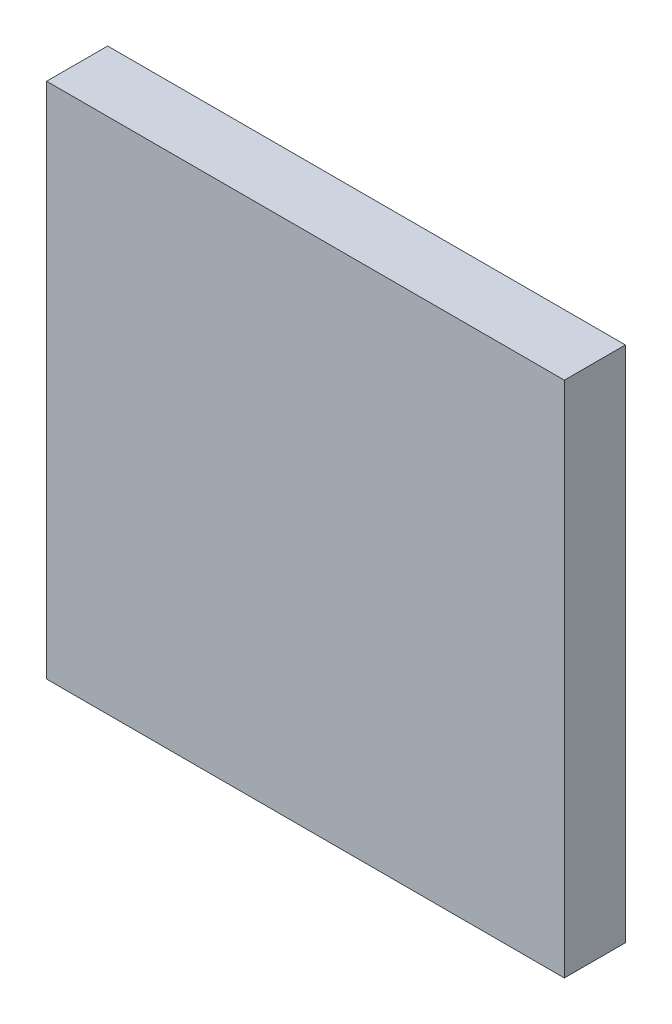
ISO-10303-21;
HEADER;
FILE_DESCRIPTION(('STEP AP214'),'2;1');
FILE_NAME('part.step','',(''),(''),'','','');
FILE_SCHEMA(('AUTOMOTIVE_DESIGN { 1 0 10303 214 1 1 1 1 }'));
ENDSEC;
DATA;
#1=APPLICATION_CONTEXT('core data for automotive mechanical design processes');
#2=APPLICATION_PROTOCOL_DEFINITION('international standard','automotive_design',2000,#1);
#3=PRODUCT_CONTEXT('',#1,'mechanical');
#4=PRODUCT('Part','Part','',(#3));
#5=PRODUCT_RELATED_PRODUCT_CATEGORY('part','',(#4));
#6=PRODUCT_DEFINITION_FORMATION('','',#4);
#7=PRODUCT_DEFINITION_CONTEXT('part definition',#1,'design');
#8=PRODUCT_DEFINITION('design','',#6,#7);
#9=PRODUCT_DEFINITION_SHAPE('','',#8);
#10=(LENGTH_UNIT() NAMED_UNIT(*) SI_UNIT(.MILLI.,.METRE.));
#11=(NAMED_UNIT(*) PLANE_ANGLE_UNIT() SI_UNIT($,.RADIAN.));
#12=(NAMED_UNIT(*) SI_UNIT($,.STERADIAN.) SOLID_ANGLE_UNIT());
#13=UNCERTAINTY_MEASURE_WITH_UNIT(LENGTH_MEASURE(1.E-05),#10,'distance_accuracy_value','');
#14=(GEOMETRIC_REPRESENTATION_CONTEXT(3) GLOBAL_UNCERTAINTY_ASSIGNED_CONTEXT((#13)) GLOBAL_UNIT_ASSIGNED_CONTEXT((#10,
#11,#12)) REPRESENTATION_CONTEXT('',''));
#15=CARTESIAN_POINT('',(0.,0.,0.));
#16=DIRECTION('',(0.,0.,1.));
#17=DIRECTION('',(1.,0.,0.));
#18=AXIS2_PLACEMENT_3D('',#15,#16,#17);
#19=CARTESIAN_POINT('',(0.359731676890786,-12.3662846645274,44.21209652793));
#20=DIRECTION('',(0.,1.,0.));
#21=DIRECTION('',(0.,0.,1.));
#22=AXIS2_PLACEMENT_3D('',#19,#20,#21);
#23=PLANE('',#22);
#24=DIRECTION('',(0.,0.,-1.));
#25=VECTOR('',#24,1.);
#26=CARTESIAN_POINT('',(0.359731676890786,-12.3662846645274,44.21209652793));
#27=LINE('',#26,#25);
#28=CARTESIAN_POINT('',(0.359731676890786,-12.3662846645274,44.21209652793));
#29=VERTEX_POINT('',#28);
#30=CARTESIAN_POINT('',(0.359731676890786,-12.3662846645274,43.6520965279299));
#31=VERTEX_POINT('',#30);
#32=EDGE_CURVE('E42',#29,#31,#27,.T.);
#33=ORIENTED_EDGE('',*,*,#32,.F.);
#34=DIRECTION('',(-1.,0.,0.));
#35=VECTOR('',#34,1.);
#36=CARTESIAN_POINT('',(0.359731676890786,-12.3662846645274,44.21209652793));
#37=LINE('',#36,#35);
#38=CARTESIAN_POINT('',(-4.39026832310921,-12.3662846645274,44.21209652793));
#39=VERTEX_POINT('',#38);
#40=EDGE_CURVE('E70',#29,#39,#37,.T.);
#41=ORIENTED_EDGE('',*,*,#40,.T.);
#42=DIRECTION('',(0.,0.,-1.));
#43=VECTOR('',#42,1.);
#44=CARTESIAN_POINT('',(-4.39026832310921,-12.3662846645274,44.21209652793));
#45=LINE('',#44,#43);
#46=CARTESIAN_POINT('',(-4.39026832310921,-12.3662846645274,43.6520965279299));
#47=VERTEX_POINT('',#46);
#48=EDGE_CURVE('E21',#39,#47,#45,.T.);
#49=ORIENTED_EDGE('',*,*,#48,.T.);
#50=DIRECTION('',(1.,0.,0.));
#51=VECTOR('',#50,1.);
#52=CARTESIAN_POINT('',(0.359731676890786,-12.3662846645274,43.6520965279299));
#53=LINE('',#52,#51);
#54=EDGE_CURVE('E27',#47,#31,#53,.T.);
#55=ORIENTED_EDGE('',*,*,#54,.T.);
#56=EDGE_LOOP('',(#33,#41,#49,#55));
#57=FACE_BOUND('',#56,.T.);
#58=ADVANCED_FACE('F17',(#57),#23,.F.);
#59=CARTESIAN_POINT('',(0.,0.,44.21209652793));
#60=DIRECTION('',(0.,0.,1.));
#61=DIRECTION('',(1.,0.,0.));
#62=AXIS2_PLACEMENT_3D('',#59,#60,#61);
#63=PLANE('',#62);
#64=DIRECTION('',(0.,1.,0.));
#65=VECTOR('',#64,1.);
#66=CARTESIAN_POINT('',(0.359731676890786,-12.3662846645274,44.21209652793));
#67=LINE('',#66,#65);
#68=CARTESIAN_POINT('',(0.359731676890786,-7.61628466452741,44.21209652793));
#69=VERTEX_POINT('',#68);
#70=EDGE_CURVE('E85',#29,#69,#67,.T.);
#71=ORIENTED_EDGE('',*,*,#70,.T.);
#72=DIRECTION('',(1.,0.,0.));
#73=VECTOR('',#72,1.);
#74=CARTESIAN_POINT('',(-4.39026832310921,-7.61628466452742,44.21209652793));
#75=LINE('',#74,#73);
#76=CARTESIAN_POINT('',(-4.39026832310921,-7.61628466452742,44.21209652793));
#77=VERTEX_POINT('',#76);
#78=EDGE_CURVE('E65',#77,#69,#75,.T.);
#79=ORIENTED_EDGE('',*,*,#78,.F.);
#80=DIRECTION('',(0.,1.,0.));
#81=VECTOR('',#80,1.);
#82=CARTESIAN_POINT('',(-4.39026832310921,-12.3662846645274,44.21209652793));
#83=LINE('',#82,#81);
#84=EDGE_CURVE('E62',#39,#77,#83,.T.);
#85=ORIENTED_EDGE('',*,*,#84,.F.);
#86=ORIENTED_EDGE('',*,*,#40,.F.);
#87=EDGE_LOOP('',(#71,#79,#85,#86));
#88=FACE_BOUND('',#87,.T.);
#89=ADVANCED_FACE('F69',(#88),#63,.T.);
#90=CARTESIAN_POINT('',(0.,0.,43.6520965279299));
#91=DIRECTION('',(0.,0.,1.));
#92=DIRECTION('',(1.,0.,0.));
#93=AXIS2_PLACEMENT_3D('',#90,#91,#92);
#94=PLANE('',#93);
#95=DIRECTION('',(0.,-1.,0.));
#96=VECTOR('',#95,1.);
#97=CARTESIAN_POINT('',(-4.39026832310921,-12.3662846645274,43.6520965279299));
#98=LINE('',#97,#96);
#99=CARTESIAN_POINT('',(-4.39026832310921,-7.61628466452742,43.6520965279299));
#100=VERTEX_POINT('',#99);
#101=EDGE_CURVE('E11',#100,#47,#98,.T.);
#102=ORIENTED_EDGE('',*,*,#101,.F.);
#103=DIRECTION('',(-1.,0.,0.));
#104=VECTOR('',#103,1.);
#105=CARTESIAN_POINT('',(0.359731676890786,-7.61628466452741,43.6520965279299));
#106=LINE('',#105,#104);
#107=CARTESIAN_POINT('',(0.359731676890786,-7.61628466452741,43.6520965279299));
#108=VERTEX_POINT('',#107);
#109=EDGE_CURVE('E80',#108,#100,#106,.T.);
#110=ORIENTED_EDGE('',*,*,#109,.F.);
#111=DIRECTION('',(0.,1.,0.));
#112=VECTOR('',#111,1.);
#113=CARTESIAN_POINT('',(0.359731676890786,-12.3662846645274,43.6520965279299));
#114=LINE('',#113,#112);
#115=EDGE_CURVE('E84',#31,#108,#114,.T.);
#116=ORIENTED_EDGE('',*,*,#115,.F.);
#117=ORIENTED_EDGE('',*,*,#54,.F.);
#118=EDGE_LOOP('',(#102,#110,#116,#117));
#119=FACE_BOUND('',#118,.T.);
#120=ADVANCED_FACE('F106',(#119),#94,.F.);
#121=CARTESIAN_POINT('',(0.359731676890786,-12.3662846645274,44.21209652793));
#122=DIRECTION('',(-1.,0.,0.));
#123=DIRECTION('',(0.,0.,1.));
#124=AXIS2_PLACEMENT_3D('',#121,#122,#123);
#125=PLANE('',#124);
#126=ORIENTED_EDGE('',*,*,#70,.F.);
#127=ORIENTED_EDGE('',*,*,#32,.T.);
#128=ORIENTED_EDGE('',*,*,#115,.T.);
#129=DIRECTION('',(0.,0.,-1.));
#130=VECTOR('',#129,1.);
#131=CARTESIAN_POINT('',(0.359731676890786,-7.61628466452741,44.21209652793));
#132=LINE('',#131,#130);
#133=EDGE_CURVE('E95',#69,#108,#132,.T.);
#134=ORIENTED_EDGE('',*,*,#133,.F.);
#135=EDGE_LOOP('',(#126,#127,#128,#134));
#136=FACE_BOUND('',#135,.T.);
#137=ADVANCED_FACE('F104',(#136),#125,.F.);
#138=CARTESIAN_POINT('',(-4.39026832310921,-12.3662846645274,44.21209652793));
#139=DIRECTION('',(1.,0.,0.));
#140=DIRECTION('',(0.,0.,-1.));
#141=AXIS2_PLACEMENT_3D('',#138,#139,#140);
#142=PLANE('',#141);
#143=ORIENTED_EDGE('',*,*,#48,.F.);
#144=ORIENTED_EDGE('',*,*,#84,.T.);
#145=DIRECTION('',(0.,0.,-1.));
#146=VECTOR('',#145,1.);
#147=CARTESIAN_POINT('',(-4.39026832310921,-7.61628466452742,44.21209652793));
#148=LINE('',#147,#146);
#149=EDGE_CURVE('E92',#77,#100,#148,.T.);
#150=ORIENTED_EDGE('',*,*,#149,.T.);
#151=ORIENTED_EDGE('',*,*,#101,.T.);
#152=EDGE_LOOP('',(#143,#144,#150,#151));
#153=FACE_BOUND('',#152,.T.);
#154=ADVANCED_FACE('F61',(#153),#142,.F.);
#155=CARTESIAN_POINT('',(0.359731676890786,-7.61628466452741,44.21209652793));
#156=DIRECTION('',(0.,-1.,0.));
#157=DIRECTION('',(1.,0.,0.));
#158=AXIS2_PLACEMENT_3D('',#155,#156,#157);
#159=PLANE('',#158);
#160=ORIENTED_EDGE('',*,*,#149,.F.);
#161=ORIENTED_EDGE('',*,*,#78,.T.);
#162=ORIENTED_EDGE('',*,*,#133,.T.);
#163=ORIENTED_EDGE('',*,*,#109,.T.);
#164=EDGE_LOOP('',(#160,#161,#162,#163));
#165=FACE_BOUND('',#164,.T.);
#166=ADVANCED_FACE('F19',(#165),#159,.F.);
#167=CLOSED_SHELL('',(#58,#89,#120,#137,#154,#166));
#168=MANIFOLD_SOLID_BREP('B1',#167);
#169=ADVANCED_BREP_SHAPE_REPRESENTATION('',(#18,#168),#14);
#170=SHAPE_DEFINITION_REPRESENTATION(#9,#169);
ENDSEC;
END-ISO-10303-21;
